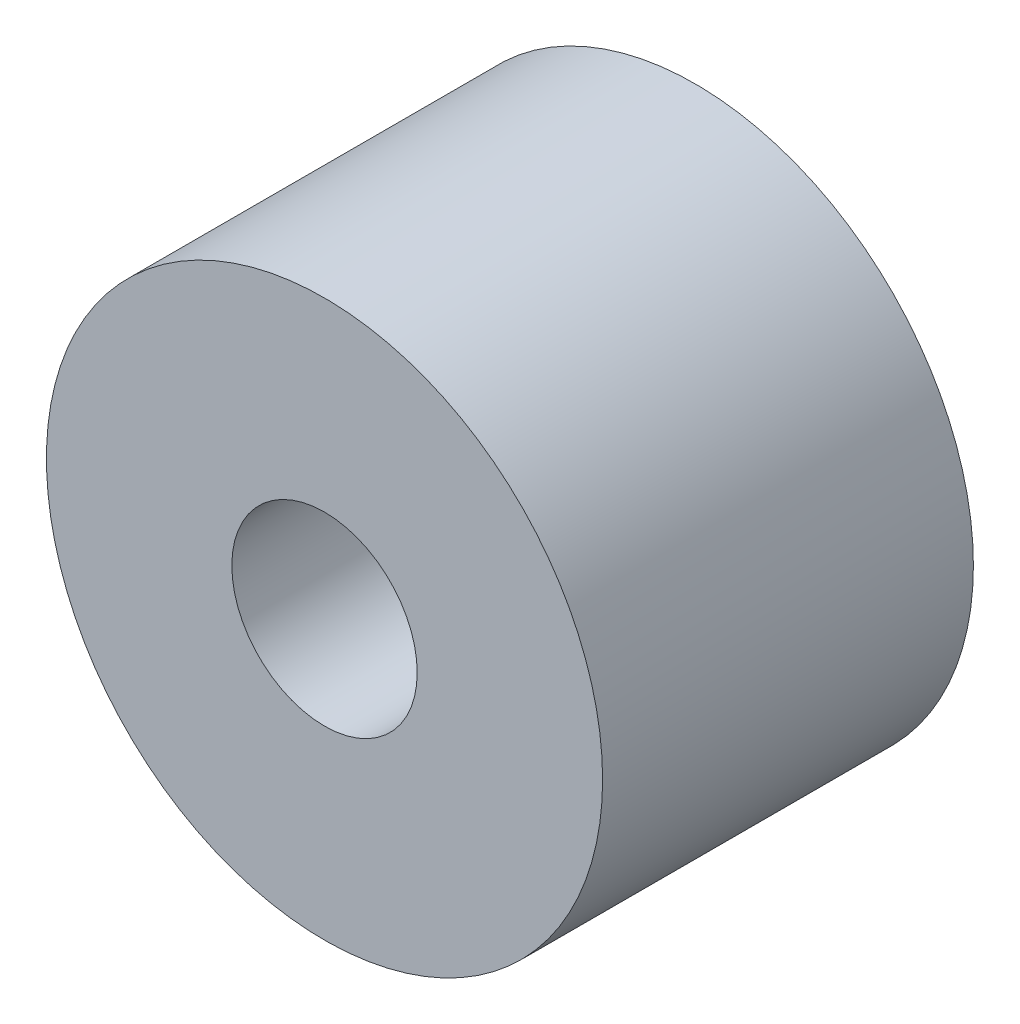
ISO-10303-21;
HEADER;
FILE_DESCRIPTION(('STEP AP214'),'2;1');
FILE_NAME('part.step','',(''),(''),'','','');
FILE_SCHEMA(('AUTOMOTIVE_DESIGN { 1 0 10303 214 1 1 1 1 }'));
ENDSEC;
DATA;
#1=APPLICATION_CONTEXT('core data for automotive mechanical design processes');
#2=APPLICATION_PROTOCOL_DEFINITION('international standard','automotive_design',2000,#1);
#3=PRODUCT_CONTEXT('',#1,'mechanical');
#4=PRODUCT('Part','Part','',(#3));
#5=PRODUCT_RELATED_PRODUCT_CATEGORY('part','',(#4));
#6=PRODUCT_DEFINITION_FORMATION('','',#4);
#7=PRODUCT_DEFINITION_CONTEXT('part definition',#1,'design');
#8=PRODUCT_DEFINITION('design','',#6,#7);
#9=PRODUCT_DEFINITION_SHAPE('','',#8);
#10=(LENGTH_UNIT() NAMED_UNIT(*) SI_UNIT(.MILLI.,.METRE.));
#11=(NAMED_UNIT(*) PLANE_ANGLE_UNIT() SI_UNIT($,.RADIAN.));
#12=(NAMED_UNIT(*) SI_UNIT($,.STERADIAN.) SOLID_ANGLE_UNIT());
#13=UNCERTAINTY_MEASURE_WITH_UNIT(LENGTH_MEASURE(1.E-05),#10,'distance_accuracy_value','');
#14=(GEOMETRIC_REPRESENTATION_CONTEXT(3) GLOBAL_UNCERTAINTY_ASSIGNED_CONTEXT((#13)) GLOBAL_UNIT_ASSIGNED_CONTEXT((#10,
#11,#12)) REPRESENTATION_CONTEXT('',''));
#15=CARTESIAN_POINT('',(0.,0.,0.));
#16=DIRECTION('',(0.,0.,1.));
#17=DIRECTION('',(1.,0.,0.));
#18=AXIS2_PLACEMENT_3D('',#15,#16,#17);
#19=CARTESIAN_POINT('',(0.,0.,8.));
#20=DIRECTION('',(0.,0.,1.));
#21=DIRECTION('',(1.,0.,0.));
#22=AXIS2_PLACEMENT_3D('',#19,#20,#21);
#23=PLANE('',#22);
#24=CARTESIAN_POINT('',(0.,0.,8.));
#25=DIRECTION('',(0.,0.,1.));
#26=DIRECTION('',(1.,0.,0.));
#27=AXIS2_PLACEMENT_3D('',#24,#25,#26);
#28=CIRCLE('',#27,6.);
#29=CARTESIAN_POINT('',(6.,0.,8.));
#30=VERTEX_POINT('',#29);
#31=EDGE_CURVE('E10',#30,#30,#28,.T.);
#32=ORIENTED_EDGE('',*,*,#31,.T.);
#33=EDGE_LOOP('',(#32));
#34=FACE_BOUND('',#33,.T.);
#35=CARTESIAN_POINT('',(0.,0.,8.));
#36=DIRECTION('',(0.,0.,1.));
#37=DIRECTION('',(1.,0.,0.));
#38=AXIS2_PLACEMENT_3D('',#35,#36,#37);
#39=CIRCLE('',#38,2.);
#40=CARTESIAN_POINT('',(2.,0.,8.));
#41=VERTEX_POINT('',#40);
#42=EDGE_CURVE('E43',#41,#41,#39,.T.);
#43=ORIENTED_EDGE('',*,*,#42,.F.);
#44=EDGE_LOOP('',(#43));
#45=FACE_BOUND('',#44,.T.);
#46=ADVANCED_FACE('F32',(#34,#45),#23,.T.);
#47=CARTESIAN_POINT('',(0.,0.,0.));
#48=DIRECTION('',(0.,0.,1.));
#49=DIRECTION('',(1.,0.,0.));
#50=AXIS2_PLACEMENT_3D('',#47,#48,#49);
#51=PLANE('',#50);
#52=CARTESIAN_POINT('',(0.,0.,0.));
#53=DIRECTION('',(0.,0.,1.));
#54=DIRECTION('',(1.,0.,0.));
#55=AXIS2_PLACEMENT_3D('',#52,#53,#54);
#56=CIRCLE('',#55,6.);
#57=CARTESIAN_POINT('',(6.,0.,0.));
#58=VERTEX_POINT('',#57);
#59=EDGE_CURVE('E36',#58,#58,#56,.T.);
#60=ORIENTED_EDGE('',*,*,#59,.F.);
#61=EDGE_LOOP('',(#60));
#62=FACE_BOUND('',#61,.T.);
#63=CARTESIAN_POINT('',(0.,0.,0.));
#64=DIRECTION('',(0.,0.,1.));
#65=DIRECTION('',(1.,0.,0.));
#66=AXIS2_PLACEMENT_3D('',#63,#64,#65);
#67=CIRCLE('',#66,2.);
#68=CARTESIAN_POINT('',(2.,0.,0.));
#69=VERTEX_POINT('',#68);
#70=EDGE_CURVE('E45',#69,#69,#67,.T.);
#71=ORIENTED_EDGE('',*,*,#70,.T.);
#72=EDGE_LOOP('',(#71));
#73=FACE_BOUND('',#72,.T.);
#74=ADVANCED_FACE('F55',(#62,#73),#51,.F.);
#75=CARTESIAN_POINT('',(0.,0.,8.));
#76=DIRECTION('',(0.,0.,-1.));
#77=DIRECTION('',(-1.,0.,0.));
#78=AXIS2_PLACEMENT_3D('',#75,#76,#77);
#79=CYLINDRICAL_SURFACE('',#78,6.);
#80=ORIENTED_EDGE('',*,*,#31,.F.);
#81=EDGE_LOOP('',(#80));
#82=FACE_BOUND('',#81,.T.);
#83=ORIENTED_EDGE('',*,*,#59,.T.);
#84=EDGE_LOOP('',(#83));
#85=FACE_BOUND('',#84,.T.);
#86=ADVANCED_FACE('F34',(#82,#85),#79,.T.);
#87=CARTESIAN_POINT('',(0.,0.,8.));
#88=DIRECTION('',(0.,0.,-1.));
#89=DIRECTION('',(-1.,0.,0.));
#90=AXIS2_PLACEMENT_3D('',#87,#88,#89);
#91=CYLINDRICAL_SURFACE('',#90,2.);
#92=ORIENTED_EDGE('',*,*,#42,.T.);
#93=EDGE_LOOP('',(#92));
#94=FACE_BOUND('',#93,.T.);
#95=ORIENTED_EDGE('',*,*,#70,.F.);
#96=EDGE_LOOP('',(#95));
#97=FACE_BOUND('',#96,.T.);
#98=ADVANCED_FACE('F51',(#94,#97),#91,.F.);
#99=CLOSED_SHELL('',(#46,#74,#86,#98));
#100=MANIFOLD_SOLID_BREP('B2',#99);
#101=ADVANCED_BREP_SHAPE_REPRESENTATION('',(#18,#100),#14);
#102=SHAPE_DEFINITION_REPRESENTATION(#9,#101);
ENDSEC;
END-ISO-10303-21;
